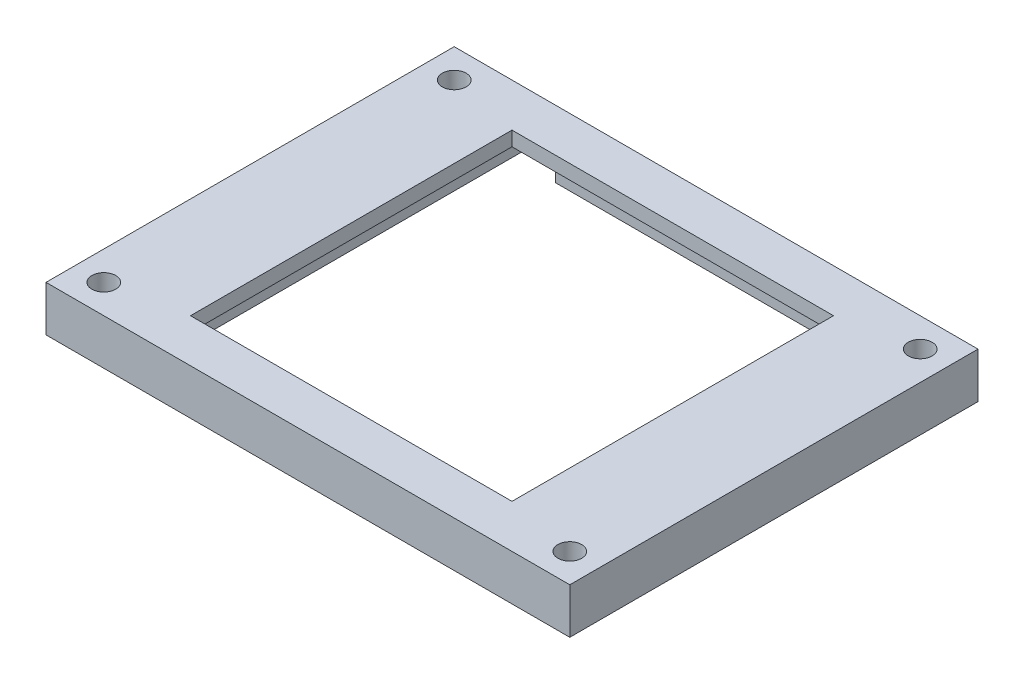
ISO-10303-21;
HEADER;
FILE_DESCRIPTION(('STEP AP214'),'2;1');
FILE_NAME('part.step','',(''),(''),'','','');
FILE_SCHEMA(('AUTOMOTIVE_DESIGN { 1 0 10303 214 1 1 1 1 }'));
ENDSEC;
DATA;
#1=APPLICATION_CONTEXT('core data for automotive mechanical design processes');
#2=APPLICATION_PROTOCOL_DEFINITION('international standard','automotive_design',2000,#1);
#3=PRODUCT_CONTEXT('',#1,'mechanical');
#4=PRODUCT('Part','Part','',(#3));
#5=PRODUCT_RELATED_PRODUCT_CATEGORY('part','',(#4));
#6=PRODUCT_DEFINITION_FORMATION('','',#4);
#7=PRODUCT_DEFINITION_CONTEXT('part definition',#1,'design');
#8=PRODUCT_DEFINITION('design','',#6,#7);
#9=PRODUCT_DEFINITION_SHAPE('','',#8);
#10=(LENGTH_UNIT() NAMED_UNIT(*) SI_UNIT(.MILLI.,.METRE.));
#11=(NAMED_UNIT(*) PLANE_ANGLE_UNIT() SI_UNIT($,.RADIAN.));
#12=(NAMED_UNIT(*) SI_UNIT($,.STERADIAN.) SOLID_ANGLE_UNIT());
#13=UNCERTAINTY_MEASURE_WITH_UNIT(LENGTH_MEASURE(1.E-05),#10,'distance_accuracy_value','');
#14=(GEOMETRIC_REPRESENTATION_CONTEXT(3) GLOBAL_UNCERTAINTY_ASSIGNED_CONTEXT((#13)) GLOBAL_UNIT_ASSIGNED_CONTEXT((#10,
#11,#12)) REPRESENTATION_CONTEXT('',''));
#15=CARTESIAN_POINT('',(0.,0.,0.));
#16=DIRECTION('',(0.,0.,1.));
#17=DIRECTION('',(1.,0.,0.));
#18=AXIS2_PLACEMENT_3D('',#15,#16,#17);
#19=CARTESIAN_POINT('',(25.25,8.6,0.));
#20=DIRECTION('',(1.,0.,0.));
#21=DIRECTION('',(0.,0.,-1.));
#22=AXIS2_PLACEMENT_3D('',#19,#20,#21);
#23=PLANE('',#22);
#24=DIRECTION('',(0.,1.,0.));
#25=VECTOR('',#24,1.);
#26=CARTESIAN_POINT('',(25.25,8.6,-28.25));
#27=LINE('',#26,#25);
#28=CARTESIAN_POINT('',(25.25,2.3,-28.25));
#29=VERTEX_POINT('',#28);
#30=CARTESIAN_POINT('',(25.25,6.6,-28.25));
#31=VERTEX_POINT('',#30);
#32=EDGE_CURVE('E205',#29,#31,#27,.T.);
#33=ORIENTED_EDGE('',*,*,#32,.F.);
#34=DIRECTION('',(0.,0.,-1.));
#35=VECTOR('',#34,1.);
#36=CARTESIAN_POINT('',(25.25,2.3,0.));
#37=LINE('',#36,#35);
#38=CARTESIAN_POINT('',(25.25,2.3,25.25));
#39=VERTEX_POINT('',#38);
#40=EDGE_CURVE('E239',#39,#29,#37,.T.);
#41=ORIENTED_EDGE('',*,*,#40,.F.);
#42=DIRECTION('',(0.,-1.,0.));
#43=VECTOR('',#42,1.);
#44=CARTESIAN_POINT('',(25.25,8.6,25.25));
#45=LINE('',#44,#43);
#46=CARTESIAN_POINT('',(25.25,6.6,25.25));
#47=VERTEX_POINT('',#46);
#48=EDGE_CURVE('E319',#47,#39,#45,.T.);
#49=ORIENTED_EDGE('',*,*,#48,.F.);
#50=DIRECTION('',(0.,0.,-1.));
#51=VECTOR('',#50,1.);
#52=CARTESIAN_POINT('',(25.25,6.6,-25.25));
#53=LINE('',#52,#51);
#54=EDGE_CURVE('E293',#47,#31,#53,.T.);
#55=ORIENTED_EDGE('',*,*,#54,.T.);
#56=EDGE_LOOP('',(#33,#41,#49,#55));
#57=FACE_BOUND('',#56,.T.);
#58=ADVANCED_FACE('F65',(#57),#23,.F.);
#59=CARTESIAN_POINT('',(-25.25,8.6,0.));
#60=DIRECTION('',(1.,0.,0.));
#61=DIRECTION('',(0.,0.,-1.));
#62=AXIS2_PLACEMENT_3D('',#59,#60,#61);
#63=PLANE('',#62);
#64=DIRECTION('',(0.,0.,-1.));
#65=VECTOR('',#64,1.);
#66=CARTESIAN_POINT('',(-25.25,2.3,0.));
#67=LINE('',#66,#65);
#68=CARTESIAN_POINT('',(-25.25,2.3,25.25));
#69=VERTEX_POINT('',#68);
#70=CARTESIAN_POINT('',(-25.25,2.3,-28.25));
#71=VERTEX_POINT('',#70);
#72=EDGE_CURVE('E233',#69,#71,#67,.T.);
#73=ORIENTED_EDGE('',*,*,#72,.T.);
#74=DIRECTION('',(0.,1.,0.));
#75=VECTOR('',#74,1.);
#76=CARTESIAN_POINT('',(-25.25,8.6,-28.25));
#77=LINE('',#76,#75);
#78=CARTESIAN_POINT('',(-25.25,6.6,-28.25));
#79=VERTEX_POINT('',#78);
#80=EDGE_CURVE('E80',#71,#79,#77,.T.);
#81=ORIENTED_EDGE('',*,*,#80,.T.);
#82=DIRECTION('',(0.,0.,1.));
#83=VECTOR('',#82,1.);
#84=CARTESIAN_POINT('',(-25.25,6.6,-25.25));
#85=LINE('',#84,#83);
#86=CARTESIAN_POINT('',(-25.25,6.6,25.25));
#87=VERTEX_POINT('',#86);
#88=EDGE_CURVE('E299',#79,#87,#85,.T.);
#89=ORIENTED_EDGE('',*,*,#88,.T.);
#90=DIRECTION('',(0.,-1.,0.));
#91=VECTOR('',#90,1.);
#92=CARTESIAN_POINT('',(-25.25,8.6,25.25));
#93=LINE('',#92,#91);
#94=EDGE_CURVE('E316',#87,#69,#93,.T.);
#95=ORIENTED_EDGE('',*,*,#94,.T.);
#96=EDGE_LOOP('',(#73,#81,#89,#95));
#97=FACE_BOUND('',#96,.T.);
#98=ADVANCED_FACE('F341',(#97),#63,.T.);
#99=CARTESIAN_POINT('',(-19.25,6.6,-19.8890560934738));
#100=DIRECTION('',(-1.,0.,0.));
#101=DIRECTION('',(0.,0.,1.));
#102=AXIS2_PLACEMENT_3D('',#99,#100,#101);
#103=PLANE('',#102);
#104=DIRECTION('',(0.,0.,-1.));
#105=VECTOR('',#104,1.);
#106=CARTESIAN_POINT('',(-19.25,6.6,-19.8890560934738));
#107=LINE('',#106,#105);
#108=CARTESIAN_POINT('',(-19.25,6.6,-25.25));
#109=VERTEX_POINT('',#108);
#110=CARTESIAN_POINT('',(-19.25,6.6,-28.25));
#111=VERTEX_POINT('',#110);
#112=EDGE_CURVE('E254',#109,#111,#107,.T.);
#113=ORIENTED_EDGE('',*,*,#112,.T.);
#114=DIRECTION('',(0.,-1.,0.));
#115=VECTOR('',#114,1.);
#116=CARTESIAN_POINT('',(-19.25,6.6,-28.25));
#117=LINE('',#116,#115);
#118=CARTESIAN_POINT('',(-19.25,2.3,-28.25));
#119=VERTEX_POINT('',#118);
#120=EDGE_CURVE('E213',#111,#119,#117,.T.);
#121=ORIENTED_EDGE('',*,*,#120,.T.);
#122=DIRECTION('',(0.,0.,1.));
#123=VECTOR('',#122,1.);
#124=CARTESIAN_POINT('',(-19.25,2.3,-19.8890560934738));
#125=LINE('',#124,#123);
#126=CARTESIAN_POINT('',(-19.25,2.3,-25.25));
#127=VERTEX_POINT('',#126);
#128=EDGE_CURVE('E223',#119,#127,#125,.T.);
#129=ORIENTED_EDGE('',*,*,#128,.T.);
#130=DIRECTION('',(0.,1.,0.));
#131=VECTOR('',#130,1.);
#132=CARTESIAN_POINT('',(-19.25,8.6,-25.25));
#133=LINE('',#132,#131);
#134=EDGE_CURVE('E261',#127,#109,#133,.T.);
#135=ORIENTED_EDGE('',*,*,#134,.T.);
#136=EDGE_LOOP('',(#113,#121,#129,#135));
#137=FACE_BOUND('',#136,.T.);
#138=ADVANCED_FACE('F346',(#137),#103,.T.);
#139=CARTESIAN_POINT('',(19.25,6.6,-19.8890560934738));
#140=DIRECTION('',(1.,0.,0.));
#141=DIRECTION('',(0.,0.,-1.));
#142=AXIS2_PLACEMENT_3D('',#139,#140,#141);
#143=PLANE('',#142);
#144=DIRECTION('',(0.,0.,-1.));
#145=VECTOR('',#144,1.);
#146=CARTESIAN_POINT('',(19.25,2.3,-19.8890560934738));
#147=LINE('',#146,#145);
#148=CARTESIAN_POINT('',(19.25,2.3,-25.25));
#149=VERTEX_POINT('',#148);
#150=CARTESIAN_POINT('',(19.25,2.3,-28.25));
#151=VERTEX_POINT('',#150);
#152=EDGE_CURVE('E321',#149,#151,#147,.T.);
#153=ORIENTED_EDGE('',*,*,#152,.T.);
#154=DIRECTION('',(0.,1.,0.));
#155=VECTOR('',#154,1.);
#156=CARTESIAN_POINT('',(19.25,6.6,-28.25));
#157=LINE('',#156,#155);
#158=CARTESIAN_POINT('',(19.25,6.6,-28.25));
#159=VERTEX_POINT('',#158);
#160=EDGE_CURVE('E209',#151,#159,#157,.T.);
#161=ORIENTED_EDGE('',*,*,#160,.T.);
#162=DIRECTION('',(0.,0.,1.));
#163=VECTOR('',#162,1.);
#164=CARTESIAN_POINT('',(19.25,6.6,-19.8890560934738));
#165=LINE('',#164,#163);
#166=CARTESIAN_POINT('',(19.25,6.6,-25.25));
#167=VERTEX_POINT('',#166);
#168=EDGE_CURVE('E253',#159,#167,#165,.T.);
#169=ORIENTED_EDGE('',*,*,#168,.T.);
#170=DIRECTION('',(0.,-1.,0.));
#171=VECTOR('',#170,1.);
#172=CARTESIAN_POINT('',(19.25,8.6,-25.25));
#173=LINE('',#172,#171);
#174=EDGE_CURVE('E257',#167,#149,#173,.T.);
#175=ORIENTED_EDGE('',*,*,#174,.T.);
#176=EDGE_LOOP('',(#153,#161,#169,#175));
#177=FACE_BOUND('',#176,.T.);
#178=ADVANCED_FACE('F353',(#177),#143,.T.);
#179=CARTESIAN_POINT('',(0.,8.6,0.));
#180=DIRECTION('',(0.,1.,0.));
#181=DIRECTION('',(0.,0.,1.));
#182=AXIS2_PLACEMENT_3D('',#179,#180,#181);
#183=PLANE('',#182);
#184=CARTESIAN_POINT('',(32.25,8.6,24.25));
#185=DIRECTION('',(0.,1.,0.));
#186=DIRECTION('',(0.,0.,1.));
#187=AXIS2_PLACEMENT_3D('',#184,#185,#186);
#188=CIRCLE('',#187,1.65);
#189=CARTESIAN_POINT('',(32.25,8.6,25.9));
#190=VERTEX_POINT('',#189);
#191=EDGE_CURVE('E197',#190,#190,#188,.T.);
#192=ORIENTED_EDGE('',*,*,#191,.F.);
#193=EDGE_LOOP('',(#192));
#194=FACE_BOUND('',#193,.T.);
#195=CARTESIAN_POINT('',(-32.25,8.6,24.25));
#196=DIRECTION('',(0.,1.,0.));
#197=DIRECTION('',(0.,0.,1.));
#198=AXIS2_PLACEMENT_3D('',#195,#196,#197);
#199=CIRCLE('',#198,1.65);
#200=CARTESIAN_POINT('',(-32.25,8.6,25.9));
#201=VERTEX_POINT('',#200);
#202=EDGE_CURVE('E307',#201,#201,#199,.F.);
#203=ORIENTED_EDGE('',*,*,#202,.T.);
#204=EDGE_LOOP('',(#203));
#205=FACE_BOUND('',#204,.T.);
#206=CARTESIAN_POINT('',(-32.25,8.6,-24.25));
#207=DIRECTION('',(0.,1.,0.));
#208=DIRECTION('',(0.,0.,1.));
#209=AXIS2_PLACEMENT_3D('',#206,#207,#208);
#210=CIRCLE('',#209,1.65);
#211=CARTESIAN_POINT('',(-32.25,8.6,-22.6));
#212=VERTEX_POINT('',#211);
#213=EDGE_CURVE('E310',#212,#212,#210,.T.);
#214=ORIENTED_EDGE('',*,*,#213,.F.);
#215=EDGE_LOOP('',(#214));
#216=FACE_BOUND('',#215,.T.);
#217=CARTESIAN_POINT('',(32.25,8.6,-24.25));
#218=DIRECTION('',(0.,1.,0.));
#219=DIRECTION('',(0.,0.,1.));
#220=AXIS2_PLACEMENT_3D('',#217,#218,#219);
#221=CIRCLE('',#220,1.65);
#222=CARTESIAN_POINT('',(32.25,8.6,-22.6));
#223=VERTEX_POINT('',#222);
#224=EDGE_CURVE('E313',#223,#223,#221,.F.);
#225=ORIENTED_EDGE('',*,*,#224,.T.);
#226=EDGE_LOOP('',(#225));
#227=FACE_BOUND('',#226,.T.);
#228=DIRECTION('',(-1.,0.,0.));
#229=VECTOR('',#228,1.);
#230=CARTESIAN_POINT('',(-22.25,8.6,-22.25));
#231=LINE('',#230,#229);
#232=CARTESIAN_POINT('',(22.25,8.6,-22.25));
#233=VERTEX_POINT('',#232);
#234=CARTESIAN_POINT('',(-22.25,8.6,-22.25));
#235=VERTEX_POINT('',#234);
#236=EDGE_CURVE('E266',#233,#235,#231,.T.);
#237=ORIENTED_EDGE('',*,*,#236,.F.);
#238=DIRECTION('',(0.,0.,-1.));
#239=VECTOR('',#238,1.);
#240=CARTESIAN_POINT('',(22.25,8.6,-22.25));
#241=LINE('',#240,#239);
#242=CARTESIAN_POINT('',(22.25,8.6,22.25));
#243=VERTEX_POINT('',#242);
#244=EDGE_CURVE('E264',#243,#233,#241,.T.);
#245=ORIENTED_EDGE('',*,*,#244,.F.);
#246=DIRECTION('',(1.,0.,0.));
#247=VECTOR('',#246,1.);
#248=CARTESIAN_POINT('',(-22.25,8.6,22.25));
#249=LINE('',#248,#247);
#250=CARTESIAN_POINT('',(-22.25,8.6,22.25));
#251=VERTEX_POINT('',#250);
#252=EDGE_CURVE('E272',#251,#243,#249,.T.);
#253=ORIENTED_EDGE('',*,*,#252,.F.);
#254=DIRECTION('',(0.,0.,1.));
#255=VECTOR('',#254,1.);
#256=CARTESIAN_POINT('',(-22.25,8.6,-22.25));
#257=LINE('',#256,#255);
#258=EDGE_CURVE('E269',#235,#251,#257,.T.);
#259=ORIENTED_EDGE('',*,*,#258,.F.);
#260=EDGE_LOOP('',(#237,#245,#253,#259));
#261=FACE_BOUND('',#260,.T.);
#262=DIRECTION('',(0.,0.,-1.));
#263=VECTOR('',#262,1.);
#264=CARTESIAN_POINT('',(36.25,8.6,0.));
#265=LINE('',#264,#263);
#266=CARTESIAN_POINT('',(36.25,8.6,28.25));
#267=VERTEX_POINT('',#266);
#268=CARTESIAN_POINT('',(36.25,8.6,-28.25));
#269=VERTEX_POINT('',#268);
#270=EDGE_CURVE('E179',#267,#269,#265,.T.);
#271=ORIENTED_EDGE('',*,*,#270,.T.);
#272=DIRECTION('',(1.,0.,0.));
#273=VECTOR('',#272,1.);
#274=CARTESIAN_POINT('',(0.,8.6,-28.25));
#275=LINE('',#274,#273);
#276=CARTESIAN_POINT('',(-36.25,8.6,-28.25));
#277=VERTEX_POINT('',#276);
#278=EDGE_CURVE('E187',#277,#269,#275,.T.);
#279=ORIENTED_EDGE('',*,*,#278,.F.);
#280=DIRECTION('',(0.,0.,-1.));
#281=VECTOR('',#280,1.);
#282=CARTESIAN_POINT('',(-36.25,8.6,0.));
#283=LINE('',#282,#281);
#284=CARTESIAN_POINT('',(-36.25,8.6,28.25));
#285=VERTEX_POINT('',#284);
#286=EDGE_CURVE('E194',#285,#277,#283,.T.);
#287=ORIENTED_EDGE('',*,*,#286,.F.);
#288=DIRECTION('',(1.,0.,0.));
#289=VECTOR('',#288,1.);
#290=CARTESIAN_POINT('',(0.,8.6,28.25));
#291=LINE('',#290,#289);
#292=EDGE_CURVE('E191',#285,#267,#291,.T.);
#293=ORIENTED_EDGE('',*,*,#292,.T.);
#294=EDGE_LOOP('',(#271,#279,#287,#293));
#295=FACE_BOUND('',#294,.T.);
#296=ADVANCED_FACE('F192',(#194,#205,#216,#227,#261,#295),#183,.T.);
#297=CARTESIAN_POINT('',(0.,6.6,0.));
#298=DIRECTION('',(0.,1.,0.));
#299=DIRECTION('',(0.,0.,1.));
#300=AXIS2_PLACEMENT_3D('',#297,#298,#299);
#301=PLANE('',#300);
#302=DIRECTION('',(-1.,0.,0.));
#303=VECTOR('',#302,1.);
#304=CARTESIAN_POINT('',(-22.25,6.6,-22.25));
#305=LINE('',#304,#303);
#306=CARTESIAN_POINT('',(22.25,6.6,-22.25));
#307=VERTEX_POINT('',#306);
#308=CARTESIAN_POINT('',(-22.25,6.6,-22.25));
#309=VERTEX_POINT('',#308);
#310=EDGE_CURVE('E276',#307,#309,#305,.T.);
#311=ORIENTED_EDGE('',*,*,#310,.T.);
#312=DIRECTION('',(0.,0.,1.));
#313=VECTOR('',#312,1.);
#314=CARTESIAN_POINT('',(-22.25,6.6,-22.25));
#315=LINE('',#314,#313);
#316=CARTESIAN_POINT('',(-22.25,6.6,22.25));
#317=VERTEX_POINT('',#316);
#318=EDGE_CURVE('E278',#309,#317,#315,.T.);
#319=ORIENTED_EDGE('',*,*,#318,.T.);
#320=DIRECTION('',(1.,0.,0.));
#321=VECTOR('',#320,1.);
#322=CARTESIAN_POINT('',(-22.25,6.6,22.25));
#323=LINE('',#322,#321);
#324=CARTESIAN_POINT('',(22.25,6.6,22.25));
#325=VERTEX_POINT('',#324);
#326=EDGE_CURVE('E267',#317,#325,#323,.T.);
#327=ORIENTED_EDGE('',*,*,#326,.T.);
#328=DIRECTION('',(0.,0.,-1.));
#329=VECTOR('',#328,1.);
#330=CARTESIAN_POINT('',(22.25,6.6,-22.25));
#331=LINE('',#330,#329);
#332=EDGE_CURVE('E263',#325,#307,#331,.T.);
#333=ORIENTED_EDGE('',*,*,#332,.T.);
#334=EDGE_LOOP('',(#311,#319,#327,#333));
#335=FACE_BOUND('',#334,.T.);
#336=DIRECTION('',(-1.,0.,0.));
#337=VECTOR('',#336,1.);
#338=CARTESIAN_POINT('',(0.,6.6,-28.25));
#339=LINE('',#338,#337);
#340=EDGE_CURVE('E207',#31,#159,#339,.T.);
#341=ORIENTED_EDGE('',*,*,#340,.F.);
#342=ORIENTED_EDGE('',*,*,#54,.F.);
#343=DIRECTION('',(1.,0.,0.));
#344=VECTOR('',#343,1.);
#345=CARTESIAN_POINT('',(-25.25,6.6,25.25));
#346=LINE('',#345,#344);
#347=EDGE_CURVE('E188',#87,#47,#346,.T.);
#348=ORIENTED_EDGE('',*,*,#347,.F.);
#349=ORIENTED_EDGE('',*,*,#88,.F.);
#350=EDGE_CURVE('E210',#111,#79,#339,.T.);
#351=ORIENTED_EDGE('',*,*,#350,.F.);
#352=ORIENTED_EDGE('',*,*,#112,.F.);
#353=DIRECTION('',(-1.,0.,0.));
#354=VECTOR('',#353,1.);
#355=CARTESIAN_POINT('',(-25.25,6.6,-25.25));
#356=LINE('',#355,#354);
#357=EDGE_CURVE('E296',#167,#109,#356,.T.);
#358=ORIENTED_EDGE('',*,*,#357,.F.);
#359=ORIENTED_EDGE('',*,*,#168,.F.);
#360=EDGE_LOOP('',(#341,#342,#348,#349,#351,#352,#358,#359));
#361=FACE_BOUND('',#360,.T.);
#362=ADVANCED_FACE('F334',(#335,#361),#301,.F.);
#363=CARTESIAN_POINT('',(0.,2.3,0.));
#364=DIRECTION('',(0.,-1.,0.));
#365=DIRECTION('',(0.,0.,-1.));
#366=AXIS2_PLACEMENT_3D('',#363,#364,#365);
#367=PLANE('',#366);
#368=ORIENTED_EDGE('',*,*,#128,.F.);
#369=DIRECTION('',(-1.,0.,0.));
#370=VECTOR('',#369,1.);
#371=CARTESIAN_POINT('',(0.,2.3,-28.25));
#372=LINE('',#371,#370);
#373=EDGE_CURVE('E225',#151,#119,#372,.T.);
#374=ORIENTED_EDGE('',*,*,#373,.F.);
#375=ORIENTED_EDGE('',*,*,#152,.F.);
#376=DIRECTION('',(-1.,0.,0.));
#377=VECTOR('',#376,1.);
#378=CARTESIAN_POINT('',(0.,2.3,-25.25));
#379=LINE('',#378,#377);
#380=EDGE_CURVE('E220',#149,#127,#379,.T.);
#381=ORIENTED_EDGE('',*,*,#380,.T.);
#382=EDGE_LOOP('',(#368,#374,#375,#381));
#383=FACE_BOUND('',#382,.T.);
#384=ADVANCED_FACE('F356',(#383),#367,.T.);
#385=DIRECTION('',(0.,0.,1.));
#386=VECTOR('',#385,1.);
#387=CARTESIAN_POINT('',(36.25,2.3,0.));
#388=LINE('',#387,#386);
#389=CARTESIAN_POINT('',(36.25,2.3,-28.25));
#390=VERTEX_POINT('',#389);
#391=CARTESIAN_POINT('',(36.25,2.3,28.25));
#392=VERTEX_POINT('',#391);
#393=EDGE_CURVE('E242',#390,#392,#388,.T.);
#394=ORIENTED_EDGE('',*,*,#393,.T.);
#395=DIRECTION('',(-1.,0.,0.));
#396=VECTOR('',#395,1.);
#397=CARTESIAN_POINT('',(0.,2.3,28.25));
#398=LINE('',#397,#396);
#399=CARTESIAN_POINT('',(-36.25,2.3,28.25));
#400=VERTEX_POINT('',#399);
#401=EDGE_CURVE('E87',#392,#400,#398,.T.);
#402=ORIENTED_EDGE('',*,*,#401,.T.);
#403=DIRECTION('',(0.,0.,-1.));
#404=VECTOR('',#403,1.);
#405=CARTESIAN_POINT('',(-36.25,2.3,0.));
#406=LINE('',#405,#404);
#407=CARTESIAN_POINT('',(-36.25,2.3,-28.25));
#408=VERTEX_POINT('',#407);
#409=EDGE_CURVE('E231',#400,#408,#406,.T.);
#410=ORIENTED_EDGE('',*,*,#409,.T.);
#411=DIRECTION('',(1.,0.,0.));
#412=VECTOR('',#411,1.);
#413=CARTESIAN_POINT('',(0.,2.3,-28.25));
#414=LINE('',#413,#412);
#415=EDGE_CURVE('E12',#408,#71,#414,.T.);
#416=ORIENTED_EDGE('',*,*,#415,.T.);
#417=ORIENTED_EDGE('',*,*,#72,.F.);
#418=DIRECTION('',(-1.,0.,0.));
#419=VECTOR('',#418,1.);
#420=CARTESIAN_POINT('',(0.,2.3,25.25));
#421=LINE('',#420,#419);
#422=EDGE_CURVE('E236',#39,#69,#421,.T.);
#423=ORIENTED_EDGE('',*,*,#422,.F.);
#424=ORIENTED_EDGE('',*,*,#40,.T.);
#425=EDGE_CURVE('E69',#29,#390,#414,.T.);
#426=ORIENTED_EDGE('',*,*,#425,.T.);
#427=EDGE_LOOP('',(#394,#402,#410,#416,#417,#423,#424,#426));
#428=FACE_BOUND('',#427,.T.);
#429=CARTESIAN_POINT('',(-32.25,2.3,-24.25));
#430=DIRECTION('',(0.,-1.,0.));
#431=DIRECTION('',(0.,0.,-1.));
#432=AXIS2_PLACEMENT_3D('',#429,#430,#431);
#433=CIRCLE('',#432,1.65);
#434=CARTESIAN_POINT('',(-32.25,2.3,-25.9));
#435=VERTEX_POINT('',#434);
#436=EDGE_CURVE('E250',#435,#435,#433,.T.);
#437=ORIENTED_EDGE('',*,*,#436,.F.);
#438=EDGE_LOOP('',(#437));
#439=FACE_BOUND('',#438,.T.);
#440=CARTESIAN_POINT('',(32.25,2.3,24.25));
#441=DIRECTION('',(0.,-1.,0.));
#442=DIRECTION('',(0.,0.,-1.));
#443=AXIS2_PLACEMENT_3D('',#440,#441,#442);
#444=CIRCLE('',#443,1.65);
#445=CARTESIAN_POINT('',(32.25,2.3,22.6));
#446=VERTEX_POINT('',#445);
#447=EDGE_CURVE('E244',#446,#446,#444,.T.);
#448=ORIENTED_EDGE('',*,*,#447,.F.);
#449=EDGE_LOOP('',(#448));
#450=FACE_BOUND('',#449,.T.);
#451=CARTESIAN_POINT('',(32.25,2.3,-24.25));
#452=DIRECTION('',(0.,-1.,0.));
#453=DIRECTION('',(0.,0.,-1.));
#454=AXIS2_PLACEMENT_3D('',#451,#452,#453);
#455=CIRCLE('',#454,1.65);
#456=CARTESIAN_POINT('',(32.25,2.3,-25.9));
#457=VERTEX_POINT('',#456);
#458=EDGE_CURVE('E227',#457,#457,#455,.F.);
#459=ORIENTED_EDGE('',*,*,#458,.T.);
#460=EDGE_LOOP('',(#459));
#461=FACE_BOUND('',#460,.T.);
#462=CARTESIAN_POINT('',(-32.25,2.3,24.25));
#463=DIRECTION('',(0.,-1.,0.));
#464=DIRECTION('',(0.,0.,-1.));
#465=AXIS2_PLACEMENT_3D('',#462,#463,#464);
#466=CIRCLE('',#465,1.65);
#467=CARTESIAN_POINT('',(-32.25,2.3,22.6));
#468=VERTEX_POINT('',#467);
#469=EDGE_CURVE('E247',#468,#468,#466,.F.);
#470=ORIENTED_EDGE('',*,*,#469,.T.);
#471=EDGE_LOOP('',(#470));
#472=FACE_BOUND('',#471,.T.);
#473=ADVANCED_FACE('F325',(#428,#439,#450,#461,#472),#367,.T.);
#474=CARTESIAN_POINT('',(0.,8.6,-25.25));
#475=DIRECTION('',(0.,0.,-1.));
#476=DIRECTION('',(-1.,0.,0.));
#477=AXIS2_PLACEMENT_3D('',#474,#475,#476);
#478=PLANE('',#477);
#479=ORIENTED_EDGE('',*,*,#380,.F.);
#480=ORIENTED_EDGE('',*,*,#174,.F.);
#481=ORIENTED_EDGE('',*,*,#357,.T.);
#482=ORIENTED_EDGE('',*,*,#134,.F.);
#483=EDGE_LOOP('',(#479,#480,#481,#482));
#484=FACE_BOUND('',#483,.T.);
#485=ADVANCED_FACE('F351',(#484),#478,.F.);
#486=CARTESIAN_POINT('',(0.,8.6,25.25));
#487=DIRECTION('',(0.,0.,-1.));
#488=DIRECTION('',(-1.,0.,0.));
#489=AXIS2_PLACEMENT_3D('',#486,#487,#488);
#490=PLANE('',#489);
#491=ORIENTED_EDGE('',*,*,#48,.T.);
#492=ORIENTED_EDGE('',*,*,#422,.T.);
#493=ORIENTED_EDGE('',*,*,#94,.F.);
#494=ORIENTED_EDGE('',*,*,#347,.T.);
#495=EDGE_LOOP('',(#491,#492,#493,#494));
#496=FACE_BOUND('',#495,.T.);
#497=ADVANCED_FACE('F339',(#496),#490,.T.);
#498=CARTESIAN_POINT('',(0.,8.6,-28.25));
#499=DIRECTION('',(0.,0.,-1.));
#500=DIRECTION('',(-1.,0.,0.));
#501=AXIS2_PLACEMENT_3D('',#498,#499,#500);
#502=PLANE('',#501);
#503=ORIENTED_EDGE('',*,*,#278,.T.);
#504=DIRECTION('',(0.,-1.,0.));
#505=VECTOR('',#504,1.);
#506=CARTESIAN_POINT('',(36.25,8.6,-28.25));
#507=LINE('',#506,#505);
#508=EDGE_CURVE('E185',#269,#390,#507,.T.);
#509=ORIENTED_EDGE('',*,*,#508,.T.);
#510=ORIENTED_EDGE('',*,*,#425,.F.);
#511=ORIENTED_EDGE('',*,*,#32,.T.);
#512=ORIENTED_EDGE('',*,*,#340,.T.);
#513=ORIENTED_EDGE('',*,*,#160,.F.);
#514=ORIENTED_EDGE('',*,*,#373,.T.);
#515=ORIENTED_EDGE('',*,*,#120,.F.);
#516=ORIENTED_EDGE('',*,*,#350,.T.);
#517=ORIENTED_EDGE('',*,*,#80,.F.);
#518=ORIENTED_EDGE('',*,*,#415,.F.);
#519=DIRECTION('',(0.,-1.,0.));
#520=VECTOR('',#519,1.);
#521=CARTESIAN_POINT('',(-36.25,8.6,-28.25));
#522=LINE('',#521,#520);
#523=EDGE_CURVE('E217',#277,#408,#522,.T.);
#524=ORIENTED_EDGE('',*,*,#523,.F.);
#525=EDGE_LOOP('',(#503,#509,#510,#511,#512,#513,#514,#515,#516,#517,#518,#524));
#526=FACE_BOUND('',#525,.T.);
#527=ADVANCED_FACE('F67',(#526),#502,.T.);
#528=CARTESIAN_POINT('',(-36.25,8.6,0.));
#529=DIRECTION('',(1.,0.,0.));
#530=DIRECTION('',(0.,0.,-1.));
#531=AXIS2_PLACEMENT_3D('',#528,#529,#530);
#532=PLANE('',#531);
#533=ORIENTED_EDGE('',*,*,#409,.F.);
#534=DIRECTION('',(0.,1.,0.));
#535=VECTOR('',#534,1.);
#536=CARTESIAN_POINT('',(-36.25,8.6,28.25));
#537=LINE('',#536,#535);
#538=EDGE_CURVE('E200',#400,#285,#537,.T.);
#539=ORIENTED_EDGE('',*,*,#538,.T.);
#540=ORIENTED_EDGE('',*,*,#286,.T.);
#541=ORIENTED_EDGE('',*,*,#523,.T.);
#542=EDGE_LOOP('',(#533,#539,#540,#541));
#543=FACE_BOUND('',#542,.T.);
#544=ADVANCED_FACE('F382',(#543),#532,.F.);
#545=CARTESIAN_POINT('',(0.,8.6,28.25));
#546=DIRECTION('',(0.,0.,-1.));
#547=DIRECTION('',(-1.,0.,0.));
#548=AXIS2_PLACEMENT_3D('',#545,#546,#547);
#549=PLANE('',#548);
#550=ORIENTED_EDGE('',*,*,#401,.F.);
#551=DIRECTION('',(0.,1.,0.));
#552=VECTOR('',#551,1.);
#553=CARTESIAN_POINT('',(36.25,8.6,28.25));
#554=LINE('',#553,#552);
#555=EDGE_CURVE('E184',#392,#267,#554,.T.);
#556=ORIENTED_EDGE('',*,*,#555,.T.);
#557=ORIENTED_EDGE('',*,*,#292,.F.);
#558=ORIENTED_EDGE('',*,*,#538,.F.);
#559=EDGE_LOOP('',(#550,#556,#557,#558));
#560=FACE_BOUND('',#559,.T.);
#561=ADVANCED_FACE('F199',(#560),#549,.F.);
#562=CARTESIAN_POINT('',(36.25,8.6,0.));
#563=DIRECTION('',(1.,0.,0.));
#564=DIRECTION('',(0.,0.,-1.));
#565=AXIS2_PLACEMENT_3D('',#562,#563,#564);
#566=PLANE('',#565);
#567=ORIENTED_EDGE('',*,*,#555,.F.);
#568=ORIENTED_EDGE('',*,*,#393,.F.);
#569=ORIENTED_EDGE('',*,*,#508,.F.);
#570=ORIENTED_EDGE('',*,*,#270,.F.);
#571=EDGE_LOOP('',(#567,#568,#569,#570));
#572=FACE_BOUND('',#571,.T.);
#573=ADVANCED_FACE('F181',(#572),#566,.T.);
#574=CARTESIAN_POINT('',(-32.25,8.6,-24.25));
#575=DIRECTION('',(0.,-1.,0.));
#576=DIRECTION('',(0.,0.,-1.));
#577=AXIS2_PLACEMENT_3D('',#574,#575,#576);
#578=CYLINDRICAL_SURFACE('',#577,1.65);
#579=ORIENTED_EDGE('',*,*,#213,.T.);
#580=EDGE_LOOP('',(#579));
#581=FACE_BOUND('',#580,.T.);
#582=ORIENTED_EDGE('',*,*,#436,.T.);
#583=EDGE_LOOP('',(#582));
#584=FACE_BOUND('',#583,.T.);
#585=ADVANCED_FACE('F380',(#581,#584),#578,.F.);
#586=CARTESIAN_POINT('',(-32.25,8.6,24.25));
#587=DIRECTION('',(0.,-1.,0.));
#588=DIRECTION('',(0.,0.,-1.));
#589=AXIS2_PLACEMENT_3D('',#586,#587,#588);
#590=CYLINDRICAL_SURFACE('',#589,1.65);
#591=ORIENTED_EDGE('',*,*,#202,.F.);
#592=EDGE_LOOP('',(#591));
#593=FACE_BOUND('',#592,.T.);
#594=ORIENTED_EDGE('',*,*,#469,.F.);
#595=EDGE_LOOP('',(#594));
#596=FACE_BOUND('',#595,.T.);
#597=ADVANCED_FACE('F404',(#593,#596),#590,.F.);
#598=CARTESIAN_POINT('',(32.25,8.6,24.25));
#599=DIRECTION('',(0.,-1.,0.));
#600=DIRECTION('',(0.,0.,-1.));
#601=AXIS2_PLACEMENT_3D('',#598,#599,#600);
#602=CYLINDRICAL_SURFACE('',#601,1.65);
#603=ORIENTED_EDGE('',*,*,#191,.T.);
#604=EDGE_LOOP('',(#603));
#605=FACE_BOUND('',#604,.T.);
#606=ORIENTED_EDGE('',*,*,#447,.T.);
#607=EDGE_LOOP('',(#606));
#608=FACE_BOUND('',#607,.T.);
#609=ADVANCED_FACE('F413',(#605,#608),#602,.F.);
#610=CARTESIAN_POINT('',(32.25,8.6,-24.25));
#611=DIRECTION('',(0.,-1.,0.));
#612=DIRECTION('',(0.,0.,-1.));
#613=AXIS2_PLACEMENT_3D('',#610,#611,#612);
#614=CYLINDRICAL_SURFACE('',#613,1.65);
#615=ORIENTED_EDGE('',*,*,#224,.F.);
#616=EDGE_LOOP('',(#615));
#617=FACE_BOUND('',#616,.T.);
#618=ORIENTED_EDGE('',*,*,#458,.F.);
#619=EDGE_LOOP('',(#618));
#620=FACE_BOUND('',#619,.T.);
#621=ADVANCED_FACE('F420',(#617,#620),#614,.F.);
#622=CARTESIAN_POINT('',(22.25,8.6,-22.25));
#623=DIRECTION('',(-1.,0.,0.));
#624=DIRECTION('',(0.,0.,1.));
#625=AXIS2_PLACEMENT_3D('',#622,#623,#624);
#626=PLANE('',#625);
#627=ORIENTED_EDGE('',*,*,#332,.F.);
#628=DIRECTION('',(0.,-1.,0.));
#629=VECTOR('',#628,1.);
#630=CARTESIAN_POINT('',(22.25,8.6,22.25));
#631=LINE('',#630,#629);
#632=EDGE_CURVE('E274',#243,#325,#631,.T.);
#633=ORIENTED_EDGE('',*,*,#632,.F.);
#634=ORIENTED_EDGE('',*,*,#244,.T.);
#635=DIRECTION('',(0.,-1.,0.));
#636=VECTOR('',#635,1.);
#637=CARTESIAN_POINT('',(22.25,8.6,-22.25));
#638=LINE('',#637,#636);
#639=EDGE_CURVE('E290',#233,#307,#638,.T.);
#640=ORIENTED_EDGE('',*,*,#639,.T.);
#641=EDGE_LOOP('',(#627,#633,#634,#640));
#642=FACE_BOUND('',#641,.T.);
#643=ADVANCED_FACE('F427',(#642),#626,.T.);
#644=CARTESIAN_POINT('',(-22.25,8.6,-22.25));
#645=DIRECTION('',(0.,0.,1.));
#646=DIRECTION('',(1.,0.,0.));
#647=AXIS2_PLACEMENT_3D('',#644,#645,#646);
#648=PLANE('',#647);
#649=ORIENTED_EDGE('',*,*,#310,.F.);
#650=ORIENTED_EDGE('',*,*,#639,.F.);
#651=ORIENTED_EDGE('',*,*,#236,.T.);
#652=DIRECTION('',(0.,-1.,0.));
#653=VECTOR('',#652,1.);
#654=CARTESIAN_POINT('',(-22.25,8.6,-22.25));
#655=LINE('',#654,#653);
#656=EDGE_CURVE('E287',#235,#309,#655,.T.);
#657=ORIENTED_EDGE('',*,*,#656,.T.);
#658=EDGE_LOOP('',(#649,#650,#651,#657));
#659=FACE_BOUND('',#658,.T.);
#660=ADVANCED_FACE('F446',(#659),#648,.T.);
#661=CARTESIAN_POINT('',(-22.25,8.6,-22.25));
#662=DIRECTION('',(1.,0.,0.));
#663=DIRECTION('',(0.,0.,-1.));
#664=AXIS2_PLACEMENT_3D('',#661,#662,#663);
#665=PLANE('',#664);
#666=ORIENTED_EDGE('',*,*,#318,.F.);
#667=ORIENTED_EDGE('',*,*,#656,.F.);
#668=ORIENTED_EDGE('',*,*,#258,.T.);
#669=DIRECTION('',(0.,-1.,0.));
#670=VECTOR('',#669,1.);
#671=CARTESIAN_POINT('',(-22.25,8.6,22.25));
#672=LINE('',#671,#670);
#673=EDGE_CURVE('E284',#251,#317,#672,.T.);
#674=ORIENTED_EDGE('',*,*,#673,.T.);
#675=EDGE_LOOP('',(#666,#667,#668,#674));
#676=FACE_BOUND('',#675,.T.);
#677=ADVANCED_FACE('F438',(#676),#665,.T.);
#678=CARTESIAN_POINT('',(-22.25,8.6,22.25));
#679=DIRECTION('',(0.,0.,-1.));
#680=DIRECTION('',(-1.,0.,0.));
#681=AXIS2_PLACEMENT_3D('',#678,#679,#680);
#682=PLANE('',#681);
#683=ORIENTED_EDGE('',*,*,#326,.F.);
#684=ORIENTED_EDGE('',*,*,#673,.F.);
#685=ORIENTED_EDGE('',*,*,#252,.T.);
#686=ORIENTED_EDGE('',*,*,#632,.T.);
#687=EDGE_LOOP('',(#683,#684,#685,#686));
#688=FACE_BOUND('',#687,.T.);
#689=ADVANCED_FACE('F433',(#688),#682,.T.);
#690=CLOSED_SHELL('',(#58,#98,#138,#178,#296,#362,#384,#473,#485,#497,#527,#544,#561,#573,#585,
#597,#609,#621,#643,#660,#677,#689));
#691=MANIFOLD_SOLID_BREP('B2',#690);
#692=ADVANCED_BREP_SHAPE_REPRESENTATION('',(#18,#691),#14);
#693=SHAPE_DEFINITION_REPRESENTATION(#9,#692);
ENDSEC;
END-ISO-10303-21;
